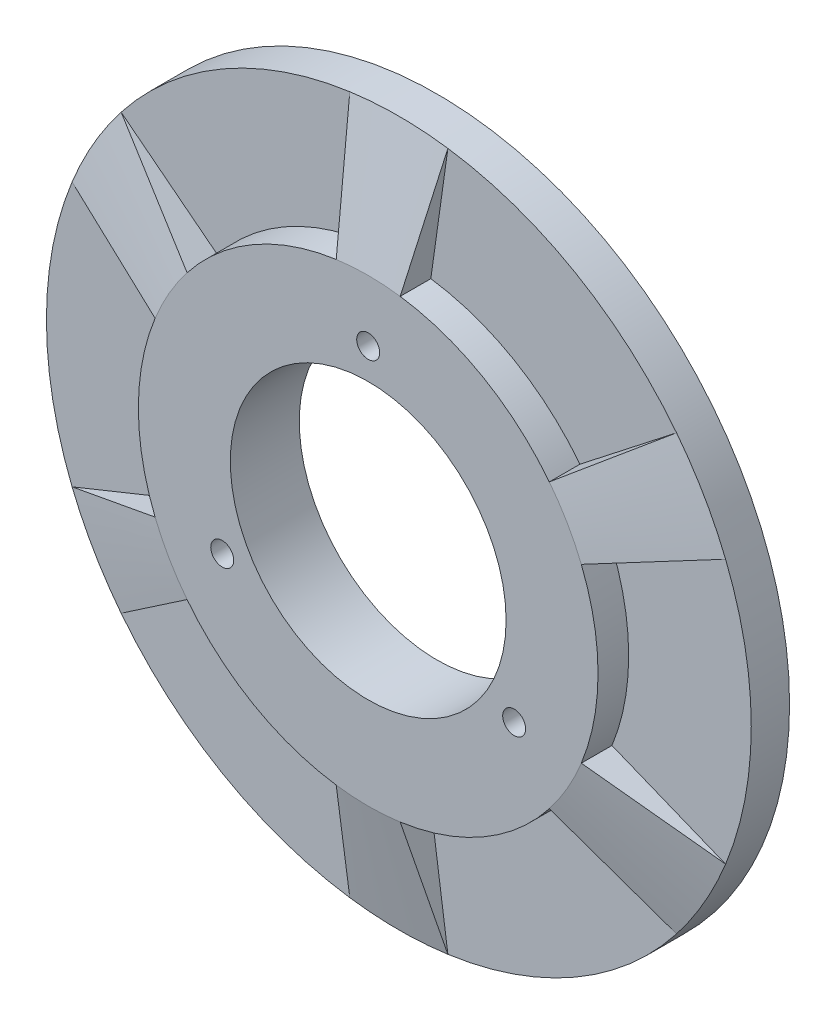
ISO-10303-21;
HEADER;
FILE_DESCRIPTION(('STEP AP214'),'2;1');
FILE_NAME('part.step','',(''),(''),'','','');
FILE_SCHEMA(('AUTOMOTIVE_DESIGN { 1 0 10303 214 1 1 1 1 }'));
ENDSEC;
DATA;
#1=APPLICATION_CONTEXT('core data for automotive mechanical design processes');
#2=APPLICATION_PROTOCOL_DEFINITION('international standard','automotive_design',2000,#1);
#3=PRODUCT_CONTEXT('',#1,'mechanical');
#4=PRODUCT('Part','Part','',(#3));
#5=PRODUCT_RELATED_PRODUCT_CATEGORY('part','',(#4));
#6=PRODUCT_DEFINITION_FORMATION('','',#4);
#7=PRODUCT_DEFINITION_CONTEXT('part definition',#1,'design');
#8=PRODUCT_DEFINITION('design','',#6,#7);
#9=PRODUCT_DEFINITION_SHAPE('','',#8);
#10=(LENGTH_UNIT() NAMED_UNIT(*) SI_UNIT(.MILLI.,.METRE.));
#11=(NAMED_UNIT(*) PLANE_ANGLE_UNIT() SI_UNIT($,.RADIAN.));
#12=(NAMED_UNIT(*) SI_UNIT($,.STERADIAN.) SOLID_ANGLE_UNIT());
#13=UNCERTAINTY_MEASURE_WITH_UNIT(LENGTH_MEASURE(1.E-05),#10,'distance_accuracy_value','');
#14=(GEOMETRIC_REPRESENTATION_CONTEXT(3) GLOBAL_UNCERTAINTY_ASSIGNED_CONTEXT((#13)) GLOBAL_UNIT_ASSIGNED_CONTEXT((#10,
#11,#12)) REPRESENTATION_CONTEXT('',''));
#15=CARTESIAN_POINT('',(0.,0.,0.));
#16=DIRECTION('',(0.,0.,1.));
#17=DIRECTION('',(1.,0.,0.));
#18=AXIS2_PLACEMENT_3D('',#15,#16,#17);
#19=CARTESIAN_POINT('',(0.,0.,5.));
#20=DIRECTION('',(0.,0.,1.));
#21=DIRECTION('',(1.,0.,0.));
#22=AXIS2_PLACEMENT_3D('',#19,#20,#21);
#23=PLANE('',#22);
#24=CARTESIAN_POINT('',(0.,0.,5.));
#25=DIRECTION('',(0.,0.,1.));
#26=DIRECTION('',(1.,0.,0.));
#27=AXIS2_PLACEMENT_3D('',#24,#25,#26);
#28=CIRCLE('',#27,46.);
#29=CARTESIAN_POINT('',(42.6504573100724,-17.2319032971315,5.));
#30=VERTEX_POINT('',#29);
#31=CARTESIAN_POINT('',(42.650457310072,17.2319032971324,5.));
#32=VERTEX_POINT('',#31);
#33=EDGE_CURVE('E241',#30,#32,#28,.T.);
#34=ORIENTED_EDGE('',*,*,#33,.T.);
#35=DIRECTION('',(0.927183854566783,0.374606593415923,0.));
#36=VECTOR('',#35,1.);
#37=CARTESIAN_POINT('',(42.650457310072,17.2319032971324,5.));
#38=LINE('',#37,#36);
#39=CARTESIAN_POINT('',(27.8155156370035,11.2381978024777,5.));
#40=VERTEX_POINT('',#39);
#41=EDGE_CURVE('E384',#40,#32,#38,.T.);
#42=ORIENTED_EDGE('',*,*,#41,.F.);
#43=CARTESIAN_POINT('',(0.,0.,5.));
#44=DIRECTION('',(0.,0.,1.));
#45=DIRECTION('',(1.,0.,0.));
#46=AXIS2_PLACEMENT_3D('',#43,#44,#45);
#47=CIRCLE('',#46,30.);
#48=CARTESIAN_POINT('',(27.8155156370037,-11.2381978024771,5.));
#49=VERTEX_POINT('',#48);
#50=EDGE_CURVE('E404',#49,#40,#47,.T.);
#51=ORIENTED_EDGE('',*,*,#50,.F.);
#52=DIRECTION('',(0.927183854566791,-0.374606593415903,0.));
#53=VECTOR('',#52,1.);
#54=CARTESIAN_POINT('',(42.6504573100724,-17.2319032971315,5.));
#55=LINE('',#54,#53);
#56=EDGE_CURVE('E377',#49,#30,#55,.T.);
#57=ORIENTED_EDGE('',*,*,#56,.T.);
#58=EDGE_LOOP('',(#34,#42,#51,#57));
#59=FACE_BOUND('',#58,.T.);
#60=ADVANCED_FACE('F86',(#59),#23,.T.);
#61=CARTESIAN_POINT('',(0.,0.,9.));
#62=DIRECTION('',(0.,0.,-1.));
#63=DIRECTION('',(-1.,0.,0.));
#64=AXIS2_PLACEMENT_3D('',#61,#62,#63);
#65=CYLINDRICAL_SURFACE('',#64,30.);
#66=DIRECTION('',(0.,0.,-1.));
#67=VECTOR('',#66,1.);
#68=CARTESIAN_POINT('',(27.8155156370035,11.2381978024777,5.));
#69=LINE('',#68,#67);
#70=CARTESIAN_POINT('',(27.8155156370035,11.2381978024777,9.));
#71=VERTEX_POINT('',#70);
#72=EDGE_CURVE('E225',#71,#40,#69,.T.);
#73=ORIENTED_EDGE('',*,*,#72,.F.);
#74=CARTESIAN_POINT('',(0.,0.,9.));
#75=DIRECTION('',(0.,0.,1.));
#76=DIRECTION('',(1.,0.,0.));
#77=AXIS2_PLACEMENT_3D('',#74,#75,#76);
#78=CIRCLE('',#77,30.);
#79=CARTESIAN_POINT('',(27.8155156370037,-11.2381978024771,9.));
#80=VERTEX_POINT('',#79);
#81=EDGE_CURVE('E391',#80,#71,#78,.T.);
#82=ORIENTED_EDGE('',*,*,#81,.F.);
#83=DIRECTION('',(0.,0.,-1.));
#84=VECTOR('',#83,1.);
#85=CARTESIAN_POINT('',(27.8155156370037,-11.2381978024771,5.));
#86=LINE('',#85,#84);
#87=EDGE_CURVE('E111',#80,#49,#86,.T.);
#88=ORIENTED_EDGE('',*,*,#87,.T.);
#89=ORIENTED_EDGE('',*,*,#50,.T.);
#90=EDGE_LOOP('',(#73,#82,#88,#89));
#91=FACE_BOUND('',#90,.T.);
#92=ADVANCED_FACE('F402',(#91),#65,.T.);
#93=CARTESIAN_POINT('',(6.40196264416302,-45.5523311621122,5.));
#94=VERTEX_POINT('',#93);
#95=CARTESIAN_POINT('',(36.2484946659095,-28.32042786498,5.));
#96=VERTEX_POINT('',#95);
#97=EDGE_CURVE('E242',#94,#96,#28,.T.);
#98=ORIENTED_EDGE('',*,*,#97,.T.);
#99=DIRECTION('',(0.788010753606727,-0.615661475325651,0.));
#100=VECTOR('',#99,1.);
#101=CARTESIAN_POINT('',(36.2484946659095,-28.32042786498,5.));
#102=LINE('',#101,#100);
#103=CARTESIAN_POINT('',(23.6403226082018,-18.4698442597695,5.));
#104=VERTEX_POINT('',#103);
#105=EDGE_CURVE('E371',#104,#96,#102,.T.);
#106=ORIENTED_EDGE('',*,*,#105,.F.);
#107=CARTESIAN_POINT('',(4.17519302880197,-29.7080420622471,5.));
#108=VERTEX_POINT('',#107);
#109=EDGE_CURVE('E406',#108,#104,#47,.T.);
#110=ORIENTED_EDGE('',*,*,#109,.F.);
#111=DIRECTION('',(0.139173100960066,-0.99026806874157,0.));
#112=VECTOR('',#111,1.);
#113=CARTESIAN_POINT('',(6.40196264416302,-45.5523311621122,5.));
#114=LINE('',#113,#112);
#115=EDGE_CURVE('E358',#108,#94,#114,.T.);
#116=ORIENTED_EDGE('',*,*,#115,.T.);
#117=EDGE_LOOP('',(#98,#106,#110,#116));
#118=FACE_BOUND('',#117,.T.);
#119=ADVANCED_FACE('F458',(#118),#23,.T.);
#120=DIRECTION('',(0.,0.,-1.));
#121=VECTOR('',#120,1.);
#122=CARTESIAN_POINT('',(23.6403226082018,-18.4698442597695,5.));
#123=LINE('',#122,#121);
#124=CARTESIAN_POINT('',(23.6403226082018,-18.4698442597695,9.));
#125=VERTEX_POINT('',#124);
#126=EDGE_CURVE('E366',#125,#104,#123,.T.);
#127=ORIENTED_EDGE('',*,*,#126,.F.);
#128=CARTESIAN_POINT('',(4.17519302880197,-29.7080420622471,9.));
#129=VERTEX_POINT('',#128);
#130=EDGE_CURVE('E806',#129,#125,#78,.T.);
#131=ORIENTED_EDGE('',*,*,#130,.F.);
#132=DIRECTION('',(0.,0.,-1.));
#133=VECTOR('',#132,1.);
#134=CARTESIAN_POINT('',(4.17519302880197,-29.7080420622471,5.));
#135=LINE('',#134,#133);
#136=EDGE_CURVE('E352',#129,#108,#135,.T.);
#137=ORIENTED_EDGE('',*,*,#136,.T.);
#138=ORIENTED_EDGE('',*,*,#109,.T.);
#139=EDGE_LOOP('',(#127,#131,#137,#138));
#140=FACE_BOUND('',#139,.T.);
#141=ADVANCED_FACE('F471',(#140),#65,.T.);
#142=CARTESIAN_POINT('',(-36.2484946659091,-28.3204278649805,5.));
#143=VERTEX_POINT('',#142);
#144=CARTESIAN_POINT('',(-6.40196264416302,-45.5523311621122,5.));
#145=VERTEX_POINT('',#144);
#146=EDGE_CURVE('E436',#143,#145,#28,.T.);
#147=ORIENTED_EDGE('',*,*,#146,.T.);
#148=DIRECTION('',(-0.139173100960066,-0.99026806874157,0.));
#149=VECTOR('',#148,1.);
#150=CARTESIAN_POINT('',(-6.40196264416302,-45.5523311621122,5.));
#151=LINE('',#150,#149);
#152=CARTESIAN_POINT('',(-4.17519302880197,-29.7080420622471,5.));
#153=VERTEX_POINT('',#152);
#154=EDGE_CURVE('E349',#153,#145,#151,.T.);
#155=ORIENTED_EDGE('',*,*,#154,.F.);
#156=CARTESIAN_POINT('',(-23.6403226082016,-18.4698442597699,5.));
#157=VERTEX_POINT('',#156);
#158=EDGE_CURVE('E408',#157,#153,#47,.T.);
#159=ORIENTED_EDGE('',*,*,#158,.F.);
#160=DIRECTION('',(-0.788010753606719,-0.615661475325662,0.));
#161=VECTOR('',#160,1.);
#162=CARTESIAN_POINT('',(-36.2484946659091,-28.3204278649805,5.));
#163=LINE('',#162,#161);
#164=EDGE_CURVE('E336',#157,#143,#163,.T.);
#165=ORIENTED_EDGE('',*,*,#164,.T.);
#166=EDGE_LOOP('',(#147,#155,#159,#165));
#167=FACE_BOUND('',#166,.T.);
#168=ADVANCED_FACE('F444',(#167),#23,.T.);
#169=DIRECTION('',(0.,0.,-1.));
#170=VECTOR('',#169,1.);
#171=CARTESIAN_POINT('',(-4.17519302880197,-29.7080420622471,5.));
#172=LINE('',#171,#170);
#173=CARTESIAN_POINT('',(-4.17519302880197,-29.7080420622471,9.));
#174=VERTEX_POINT('',#173);
#175=EDGE_CURVE('E344',#174,#153,#172,.T.);
#176=ORIENTED_EDGE('',*,*,#175,.F.);
#177=CARTESIAN_POINT('',(-23.6403226082016,-18.4698442597699,9.));
#178=VERTEX_POINT('',#177);
#179=EDGE_CURVE('E797',#178,#174,#78,.T.);
#180=ORIENTED_EDGE('',*,*,#179,.F.);
#181=DIRECTION('',(0.,0.,-1.));
#182=VECTOR('',#181,1.);
#183=CARTESIAN_POINT('',(-23.6403226082016,-18.4698442597699,5.));
#184=LINE('',#183,#182);
#185=EDGE_CURVE('E330',#178,#157,#184,.T.);
#186=ORIENTED_EDGE('',*,*,#185,.T.);
#187=ORIENTED_EDGE('',*,*,#158,.T.);
#188=EDGE_LOOP('',(#176,#180,#186,#187));
#189=FACE_BOUND('',#188,.T.);
#190=ADVANCED_FACE('F488',(#189),#65,.T.);
#191=CARTESIAN_POINT('',(-42.6504573100723,17.2319032971318,5.));
#192=VERTEX_POINT('',#191);
#193=CARTESIAN_POINT('',(-42.6504573100721,-17.2319032971321,5.));
#194=VERTEX_POINT('',#193);
#195=EDGE_CURVE('E428',#192,#194,#28,.T.);
#196=ORIENTED_EDGE('',*,*,#195,.T.);
#197=DIRECTION('',(-0.927183854566786,-0.374606593415916,0.));
#198=VECTOR('',#197,1.);
#199=CARTESIAN_POINT('',(-42.6504573100721,-17.2319032971321,5.));
#200=LINE('',#199,#198);
#201=CARTESIAN_POINT('',(-27.8155156370036,-11.2381978024775,5.));
#202=VERTEX_POINT('',#201);
#203=EDGE_CURVE('E327',#202,#194,#200,.T.);
#204=ORIENTED_EDGE('',*,*,#203,.F.);
#205=CARTESIAN_POINT('',(-27.8155156370036,11.2381978024773,5.));
#206=VERTEX_POINT('',#205);
#207=EDGE_CURVE('E253',#206,#202,#47,.T.);
#208=ORIENTED_EDGE('',*,*,#207,.F.);
#209=DIRECTION('',(-0.927183854566788,0.37460659341591,0.));
#210=VECTOR('',#209,1.);
#211=CARTESIAN_POINT('',(-42.6504573100723,17.2319032971318,5.));
#212=LINE('',#211,#210);
#213=EDGE_CURVE('E314',#206,#192,#212,.T.);
#214=ORIENTED_EDGE('',*,*,#213,.T.);
#215=EDGE_LOOP('',(#196,#204,#208,#214));
#216=FACE_BOUND('',#215,.T.);
#217=ADVANCED_FACE('F426',(#216),#23,.T.);
#218=DIRECTION('',(0.,0.,-1.));
#219=VECTOR('',#218,1.);
#220=CARTESIAN_POINT('',(-27.8155156370036,-11.2381978024775,5.));
#221=LINE('',#220,#219);
#222=CARTESIAN_POINT('',(-27.8155156370036,-11.2381978024775,9.));
#223=VERTEX_POINT('',#222);
#224=EDGE_CURVE('E322',#223,#202,#221,.T.);
#225=ORIENTED_EDGE('',*,*,#224,.F.);
#226=CARTESIAN_POINT('',(-27.8155156370036,11.2381978024773,9.));
#227=VERTEX_POINT('',#226);
#228=EDGE_CURVE('E796',#227,#223,#78,.T.);
#229=ORIENTED_EDGE('',*,*,#228,.F.);
#230=DIRECTION('',(0.,0.,-1.));
#231=VECTOR('',#230,1.);
#232=CARTESIAN_POINT('',(-27.8155156370036,11.2381978024773,5.));
#233=LINE('',#232,#231);
#234=EDGE_CURVE('E308',#227,#206,#233,.T.);
#235=ORIENTED_EDGE('',*,*,#234,.T.);
#236=ORIENTED_EDGE('',*,*,#207,.T.);
#237=EDGE_LOOP('',(#225,#229,#235,#236));
#238=FACE_BOUND('',#237,.T.);
#239=ADVANCED_FACE('F420',(#238),#65,.T.);
#240=CARTESIAN_POINT('',(-6.40196264416302,45.5523311621122,5.));
#241=VERTEX_POINT('',#240);
#242=CARTESIAN_POINT('',(-36.2484946659093,28.3204278649802,5.));
#243=VERTEX_POINT('',#242);
#244=EDGE_CURVE('E95',#241,#243,#28,.T.);
#245=ORIENTED_EDGE('',*,*,#244,.T.);
#246=DIRECTION('',(-0.788010753606723,0.615661475325657,0.));
#247=VECTOR('',#246,1.);
#248=CARTESIAN_POINT('',(-36.2484946659093,28.3204278649802,5.));
#249=LINE('',#248,#247);
#250=CARTESIAN_POINT('',(-23.6403226082017,18.4698442597697,5.));
#251=VERTEX_POINT('',#250);
#252=EDGE_CURVE('E305',#251,#243,#249,.T.);
#253=ORIENTED_EDGE('',*,*,#252,.F.);
#254=CARTESIAN_POINT('',(-4.17519302880197,29.7080420622471,5.));
#255=VERTEX_POINT('',#254);
#256=EDGE_CURVE('E249',#255,#251,#47,.T.);
#257=ORIENTED_EDGE('',*,*,#256,.F.);
#258=DIRECTION('',(-0.139173100960066,0.99026806874157,0.));
#259=VECTOR('',#258,1.);
#260=CARTESIAN_POINT('',(-6.40196264416302,45.5523311621122,5.));
#261=LINE('',#260,#259);
#262=EDGE_CURVE('E292',#255,#241,#261,.T.);
#263=ORIENTED_EDGE('',*,*,#262,.T.);
#264=EDGE_LOOP('',(#245,#253,#257,#263));
#265=FACE_BOUND('',#264,.T.);
#266=ADVANCED_FACE('F476',(#265),#23,.T.);
#267=DIRECTION('',(0.,0.,-1.));
#268=VECTOR('',#267,1.);
#269=CARTESIAN_POINT('',(-23.6403226082017,18.4698442597697,5.));
#270=LINE('',#269,#268);
#271=CARTESIAN_POINT('',(-23.6403226082017,18.4698442597697,9.));
#272=VERTEX_POINT('',#271);
#273=EDGE_CURVE('E300',#272,#251,#270,.T.);
#274=ORIENTED_EDGE('',*,*,#273,.F.);
#275=CARTESIAN_POINT('',(-4.17519302880197,29.7080420622471,9.));
#276=VERTEX_POINT('',#275);
#277=EDGE_CURVE('E256',#276,#272,#78,.T.);
#278=ORIENTED_EDGE('',*,*,#277,.F.);
#279=DIRECTION('',(0.,0.,-1.));
#280=VECTOR('',#279,1.);
#281=CARTESIAN_POINT('',(-4.17519302880197,29.7080420622471,5.));
#282=LINE('',#281,#280);
#283=EDGE_CURVE('E287',#276,#255,#282,.T.);
#284=ORIENTED_EDGE('',*,*,#283,.T.);
#285=ORIENTED_EDGE('',*,*,#256,.T.);
#286=EDGE_LOOP('',(#274,#278,#284,#285));
#287=FACE_BOUND('',#286,.T.);
#288=ADVANCED_FACE('F475',(#287),#65,.T.);
#289=DIRECTION('',(0.788010753606715,0.615661475325668,0.));
#290=VECTOR('',#289,1.);
#291=CARTESIAN_POINT('',(36.2484946659089,28.3204278649807,5.));
#292=LINE('',#291,#290);
#293=CARTESIAN_POINT('',(23.6403226082014,18.46984425977,5.));
#294=VERTEX_POINT('',#293);
#295=CARTESIAN_POINT('',(36.2484946659089,28.3204278649807,5.));
#296=VERTEX_POINT('',#295);
#297=EDGE_CURVE('E229',#294,#296,#292,.T.);
#298=ORIENTED_EDGE('',*,*,#297,.T.);
#299=CARTESIAN_POINT('',(6.40196264416302,45.5523311621122,5.));
#300=VERTEX_POINT('',#299);
#301=EDGE_CURVE('E96',#296,#300,#28,.T.);
#302=ORIENTED_EDGE('',*,*,#301,.T.);
#303=DIRECTION('',(0.139173100960066,0.99026806874157,0.));
#304=VECTOR('',#303,1.);
#305=CARTESIAN_POINT('',(6.40196264416302,45.5523311621122,5.));
#306=LINE('',#305,#304);
#307=CARTESIAN_POINT('',(4.17519302880197,29.7080420622471,5.));
#308=VERTEX_POINT('',#307);
#309=EDGE_CURVE('E284',#308,#300,#306,.T.);
#310=ORIENTED_EDGE('',*,*,#309,.F.);
#311=EDGE_CURVE('E236',#294,#308,#47,.T.);
#312=ORIENTED_EDGE('',*,*,#311,.F.);
#313=EDGE_LOOP('',(#298,#302,#310,#312));
#314=FACE_BOUND('',#313,.T.);
#315=ADVANCED_FACE('F233',(#314),#23,.T.);
#316=CARTESIAN_POINT('',(23.6403226082014,18.46984425977,9.));
#317=VERTEX_POINT('',#316);
#318=CARTESIAN_POINT('',(4.17519302880197,29.7080420622471,9.));
#319=VERTEX_POINT('',#318);
#320=EDGE_CURVE('E252',#317,#319,#78,.T.);
#321=ORIENTED_EDGE('',*,*,#320,.F.);
#322=DIRECTION('',(0.,0.,-1.));
#323=VECTOR('',#322,1.);
#324=CARTESIAN_POINT('',(23.6403226082014,18.46984425977,5.));
#325=LINE('',#324,#323);
#326=EDGE_CURVE('E103',#317,#294,#325,.T.);
#327=ORIENTED_EDGE('',*,*,#326,.T.);
#328=ORIENTED_EDGE('',*,*,#311,.T.);
#329=DIRECTION('',(0.,0.,-1.));
#330=VECTOR('',#329,1.);
#331=CARTESIAN_POINT('',(4.17519302880197,29.7080420622471,5.));
#332=LINE('',#331,#330);
#333=EDGE_CURVE('E274',#319,#308,#332,.T.);
#334=ORIENTED_EDGE('',*,*,#333,.F.);
#335=EDGE_LOOP('',(#321,#327,#328,#334));
#336=FACE_BOUND('',#335,.T.);
#337=ADVANCED_FACE('F387',(#336),#65,.T.);
#338=CARTESIAN_POINT('',(0.,0.,0.));
#339=DIRECTION('',(0.,0.,1.));
#340=DIRECTION('',(1.,0.,0.));
#341=AXIS2_PLACEMENT_3D('',#338,#339,#340);
#342=PLANE('',#341);
#343=CARTESIAN_POINT('',(0.,22.,0.));
#344=DIRECTION('',(0.,0.,1.));
#345=DIRECTION('',(1.,0.,0.));
#346=AXIS2_PLACEMENT_3D('',#343,#344,#345);
#347=CIRCLE('',#346,1.5);
#348=CARTESIAN_POINT('',(1.5,22.,0.));
#349=VERTEX_POINT('',#348);
#350=EDGE_CURVE('E260',#349,#349,#347,.T.);
#351=ORIENTED_EDGE('',*,*,#350,.T.);
#352=EDGE_LOOP('',(#351));
#353=FACE_BOUND('',#352,.T.);
#354=CARTESIAN_POINT('',(-19.0525588832577,-11.,0.));
#355=DIRECTION('',(0.,0.,1.));
#356=DIRECTION('',(1.,0.,0.));
#357=AXIS2_PLACEMENT_3D('',#354,#355,#356);
#358=CIRCLE('',#357,1.5);
#359=CARTESIAN_POINT('',(-17.5525588832577,-11.,0.));
#360=VERTEX_POINT('',#359);
#361=EDGE_CURVE('E263',#360,#360,#358,.T.);
#362=ORIENTED_EDGE('',*,*,#361,.T.);
#363=EDGE_LOOP('',(#362));
#364=FACE_BOUND('',#363,.T.);
#365=CARTESIAN_POINT('',(19.0525588832576,-11.,0.));
#366=DIRECTION('',(0.,0.,1.));
#367=DIRECTION('',(1.,0.,0.));
#368=AXIS2_PLACEMENT_3D('',#365,#366,#367);
#369=CIRCLE('',#368,1.5);
#370=CARTESIAN_POINT('',(20.5525588832576,-11.,0.));
#371=VERTEX_POINT('',#370);
#372=EDGE_CURVE('E266',#371,#371,#369,.T.);
#373=ORIENTED_EDGE('',*,*,#372,.T.);
#374=EDGE_LOOP('',(#373));
#375=FACE_BOUND('',#374,.T.);
#376=CARTESIAN_POINT('',(0.,0.,0.));
#377=DIRECTION('',(0.,0.,1.));
#378=DIRECTION('',(1.,0.,0.));
#379=AXIS2_PLACEMENT_3D('',#376,#377,#378);
#380=CIRCLE('',#379,46.);
#381=CARTESIAN_POINT('',(46.,0.,0.));
#382=VERTEX_POINT('',#381);
#383=EDGE_CURVE('E90',#382,#382,#380,.T.);
#384=ORIENTED_EDGE('',*,*,#383,.F.);
#385=EDGE_LOOP('',(#384));
#386=FACE_BOUND('',#385,.T.);
#387=CARTESIAN_POINT('',(0.,0.,0.));
#388=DIRECTION('',(0.,0.,1.));
#389=DIRECTION('',(1.,0.,0.));
#390=AXIS2_PLACEMENT_3D('',#387,#388,#389);
#391=CIRCLE('',#390,18.);
#392=CARTESIAN_POINT('',(18.,0.,0.));
#393=VERTEX_POINT('',#392);
#394=EDGE_CURVE('E244',#393,#393,#391,.T.);
#395=ORIENTED_EDGE('',*,*,#394,.T.);
#396=EDGE_LOOP('',(#395));
#397=FACE_BOUND('',#396,.T.);
#398=ADVANCED_FACE('F481',(#353,#364,#375,#386,#397),#342,.F.);
#399=CARTESIAN_POINT('',(0.,0.,5.));
#400=DIRECTION('',(0.,0.,-1.));
#401=DIRECTION('',(-1.,0.,0.));
#402=AXIS2_PLACEMENT_3D('',#399,#400,#401);
#403=CYLINDRICAL_SURFACE('',#402,46.);
#404=EDGE_CURVE('E12',#300,#241,#28,.T.);
#405=ORIENTED_EDGE('',*,*,#404,.F.);
#406=ORIENTED_EDGE('',*,*,#301,.F.);
#407=CARTESIAN_POINT('',(0.,0.,5.));
#408=DIRECTION('',(0.,0.,1.));
#409=DIRECTION('',(0.50000000000001,-0.866025403784433,0.));
#410=AXIS2_PLACEMENT_3D('',#407,#408,#409);
#411=CIRCLE('',#410,46.);
#412=EDGE_CURVE('E213',#32,#296,#411,.T.);
#413=ORIENTED_EDGE('',*,*,#412,.F.);
#414=ORIENTED_EDGE('',*,*,#33,.F.);
#415=CARTESIAN_POINT('',(0.,0.,5.));
#416=DIRECTION('',(0.,0.,1.));
#417=DIRECTION('',(-0.499999999999992,-0.866025403784443,0.));
#418=AXIS2_PLACEMENT_3D('',#415,#416,#417);
#419=CIRCLE('',#418,46.);
#420=EDGE_CURVE('E364',#96,#30,#419,.T.);
#421=ORIENTED_EDGE('',*,*,#420,.F.);
#422=ORIENTED_EDGE('',*,*,#97,.F.);
#423=CARTESIAN_POINT('',(0.,0.,5.));
#424=DIRECTION('',(0.,0.,1.));
#425=DIRECTION('',(-1.,0.,0.));
#426=AXIS2_PLACEMENT_3D('',#423,#424,#425);
#427=CIRCLE('',#426,46.);
#428=EDGE_CURVE('E342',#145,#94,#427,.T.);
#429=ORIENTED_EDGE('',*,*,#428,.F.);
#430=ORIENTED_EDGE('',*,*,#146,.F.);
#431=CARTESIAN_POINT('',(0.,0.,5.));
#432=DIRECTION('',(0.,0.,1.));
#433=DIRECTION('',(-0.500000000000004,0.866025403784436,0.));
#434=AXIS2_PLACEMENT_3D('',#431,#432,#433);
#435=CIRCLE('',#434,46.);
#436=EDGE_CURVE('E320',#194,#143,#435,.T.);
#437=ORIENTED_EDGE('',*,*,#436,.F.);
#438=ORIENTED_EDGE('',*,*,#195,.F.);
#439=CARTESIAN_POINT('',(0.,0.,5.));
#440=DIRECTION('',(0.,0.,1.));
#441=DIRECTION('',(0.499999999999998,0.86602540378444,0.));
#442=AXIS2_PLACEMENT_3D('',#439,#440,#441);
#443=CIRCLE('',#442,46.);
#444=EDGE_CURVE('E298',#243,#192,#443,.T.);
#445=ORIENTED_EDGE('',*,*,#444,.F.);
#446=ORIENTED_EDGE('',*,*,#244,.F.);
#447=EDGE_LOOP('',(#405,#406,#413,#414,#421,#422,#429,#430,#437,#438,#445,#446));
#448=FACE_BOUND('',#447,.T.);
#449=ORIENTED_EDGE('',*,*,#383,.T.);
#450=EDGE_LOOP('',(#449));
#451=FACE_BOUND('',#450,.T.);
#452=ADVANCED_FACE('F88',(#448,#451),#403,.T.);
#453=CARTESIAN_POINT('',(0.,0.,5.));
#454=DIRECTION('',(0.,0.,-1.));
#455=DIRECTION('',(-1.,0.,0.));
#456=AXIS2_PLACEMENT_3D('',#453,#454,#455);
#457=CYLINDRICAL_SURFACE('',#456,18.);
#458=ORIENTED_EDGE('',*,*,#394,.F.);
#459=EDGE_LOOP('',(#458));
#460=FACE_BOUND('',#459,.T.);
#461=CARTESIAN_POINT('',(0.,0.,9.));
#462=DIRECTION('',(0.,0.,1.));
#463=DIRECTION('',(1.,0.,0.));
#464=AXIS2_PLACEMENT_3D('',#461,#462,#463);
#465=CIRCLE('',#464,18.);
#466=CARTESIAN_POINT('',(18.,0.,9.));
#467=VERTEX_POINT('',#466);
#468=EDGE_CURVE('E257',#467,#467,#465,.T.);
#469=ORIENTED_EDGE('',*,*,#468,.T.);
#470=EDGE_LOOP('',(#469));
#471=FACE_BOUND('',#470,.T.);
#472=ADVANCED_FACE('F502',(#460,#471),#457,.F.);
#473=CARTESIAN_POINT('',(0.,0.,9.));
#474=DIRECTION('',(0.,0.,1.));
#475=DIRECTION('',(1.,0.,0.));
#476=AXIS2_PLACEMENT_3D('',#473,#474,#475);
#477=PLANE('',#476);
#478=CARTESIAN_POINT('',(0.,22.,9.));
#479=DIRECTION('',(0.,0.,-1.));
#480=DIRECTION('',(-1.,0.,0.));
#481=AXIS2_PLACEMENT_3D('',#478,#479,#480);
#482=CIRCLE('',#481,1.5);
#483=CARTESIAN_POINT('',(-1.5,22.,9.));
#484=VERTEX_POINT('',#483);
#485=EDGE_CURVE('E269',#484,#484,#482,.T.);
#486=ORIENTED_EDGE('',*,*,#485,.T.);
#487=EDGE_LOOP('',(#486));
#488=FACE_BOUND('',#487,.T.);
#489=CARTESIAN_POINT('',(-19.0525588832577,-11.,9.));
#490=DIRECTION('',(0.,0.,-1.));
#491=DIRECTION('',(-1.,0.,0.));
#492=AXIS2_PLACEMENT_3D('',#489,#490,#491);
#493=CIRCLE('',#492,1.5);
#494=CARTESIAN_POINT('',(-20.5525588832577,-11.,9.));
#495=VERTEX_POINT('',#494);
#496=EDGE_CURVE('E273',#495,#495,#493,.T.);
#497=ORIENTED_EDGE('',*,*,#496,.T.);
#498=EDGE_LOOP('',(#497));
#499=FACE_BOUND('',#498,.T.);
#500=CARTESIAN_POINT('',(19.0525588832576,-11.,9.));
#501=DIRECTION('',(0.,0.,-1.));
#502=DIRECTION('',(-1.,0.,0.));
#503=AXIS2_PLACEMENT_3D('',#500,#501,#502);
#504=CIRCLE('',#503,1.5);
#505=CARTESIAN_POINT('',(17.5525588832576,-11.,9.));
#506=VERTEX_POINT('',#505);
#507=EDGE_CURVE('E270',#506,#506,#504,.T.);
#508=ORIENTED_EDGE('',*,*,#507,.T.);
#509=EDGE_LOOP('',(#508));
#510=FACE_BOUND('',#509,.T.);
#511=EDGE_CURVE('E248',#319,#276,#78,.T.);
#512=ORIENTED_EDGE('',*,*,#511,.T.);
#513=ORIENTED_EDGE('',*,*,#277,.T.);
#514=CARTESIAN_POINT('',(0.,0.,9.));
#515=DIRECTION('',(0.,0.,1.));
#516=DIRECTION('',(0.499999999999998,0.86602540378444,0.));
#517=AXIS2_PLACEMENT_3D('',#514,#515,#516);
#518=CIRCLE('',#517,30.);
#519=EDGE_CURVE('E295',#272,#227,#518,.T.);
#520=ORIENTED_EDGE('',*,*,#519,.T.);
#521=ORIENTED_EDGE('',*,*,#228,.T.);
#522=CARTESIAN_POINT('',(0.,0.,9.));
#523=DIRECTION('',(0.,0.,1.));
#524=DIRECTION('',(-0.500000000000004,0.866025403784436,0.));
#525=AXIS2_PLACEMENT_3D('',#522,#523,#524);
#526=CIRCLE('',#525,30.);
#527=EDGE_CURVE('E317',#223,#178,#526,.T.);
#528=ORIENTED_EDGE('',*,*,#527,.T.);
#529=ORIENTED_EDGE('',*,*,#179,.T.);
#530=CARTESIAN_POINT('',(0.,0.,9.));
#531=DIRECTION('',(0.,0.,1.));
#532=DIRECTION('',(-1.,0.,0.));
#533=AXIS2_PLACEMENT_3D('',#530,#531,#532);
#534=CIRCLE('',#533,30.);
#535=EDGE_CURVE('E339',#174,#129,#534,.T.);
#536=ORIENTED_EDGE('',*,*,#535,.T.);
#537=ORIENTED_EDGE('',*,*,#130,.T.);
#538=CARTESIAN_POINT('',(0.,0.,9.));
#539=DIRECTION('',(0.,0.,1.));
#540=DIRECTION('',(-0.499999999999992,-0.866025403784443,0.));
#541=AXIS2_PLACEMENT_3D('',#538,#539,#540);
#542=CIRCLE('',#541,30.);
#543=EDGE_CURVE('E361',#125,#80,#542,.T.);
#544=ORIENTED_EDGE('',*,*,#543,.T.);
#545=ORIENTED_EDGE('',*,*,#81,.T.);
#546=CARTESIAN_POINT('',(0.,0.,9.));
#547=DIRECTION('',(0.,0.,1.));
#548=DIRECTION('',(0.50000000000001,-0.866025403784433,0.));
#549=AXIS2_PLACEMENT_3D('',#546,#547,#548);
#550=CIRCLE('',#549,30.);
#551=EDGE_CURVE('E224',#71,#317,#550,.T.);
#552=ORIENTED_EDGE('',*,*,#551,.T.);
#553=ORIENTED_EDGE('',*,*,#320,.T.);
#554=EDGE_LOOP('',(#512,#513,#520,#521,#528,#529,#536,#537,#544,#545,#552,#553));
#555=FACE_BOUND('',#554,.T.);
#556=ORIENTED_EDGE('',*,*,#468,.F.);
#557=EDGE_LOOP('',(#556));
#558=FACE_BOUND('',#557,.T.);
#559=ADVANCED_FACE('F393',(#488,#499,#510,#555,#558),#477,.T.);
#560=CARTESIAN_POINT('',(19.0525588832576,-11.,9.));
#561=DIRECTION('',(0.,0.,-1.));
#562=DIRECTION('',(-1.,0.,0.));
#563=AXIS2_PLACEMENT_3D('',#560,#561,#562);
#564=CYLINDRICAL_SURFACE('',#563,1.5);
#565=ORIENTED_EDGE('',*,*,#507,.F.);
#566=EDGE_LOOP('',(#565));
#567=FACE_BOUND('',#566,.T.);
#568=ORIENTED_EDGE('',*,*,#372,.F.);
#569=EDGE_LOOP('',(#568));
#570=FACE_BOUND('',#569,.T.);
#571=ADVANCED_FACE('F509',(#567,#570),#564,.F.);
#572=CARTESIAN_POINT('',(-19.0525588832577,-11.,9.));
#573=DIRECTION('',(0.,0.,-1.));
#574=DIRECTION('',(-1.,0.,0.));
#575=AXIS2_PLACEMENT_3D('',#572,#573,#574);
#576=CYLINDRICAL_SURFACE('',#575,1.5);
#577=ORIENTED_EDGE('',*,*,#496,.F.);
#578=EDGE_LOOP('',(#577));
#579=FACE_BOUND('',#578,.T.);
#580=ORIENTED_EDGE('',*,*,#361,.F.);
#581=EDGE_LOOP('',(#580));
#582=FACE_BOUND('',#581,.T.);
#583=ADVANCED_FACE('F528',(#579,#582),#576,.F.);
#584=CARTESIAN_POINT('',(0.,22.,9.));
#585=DIRECTION('',(0.,0.,-1.));
#586=DIRECTION('',(-1.,0.,0.));
#587=AXIS2_PLACEMENT_3D('',#584,#585,#586);
#588=CYLINDRICAL_SURFACE('',#587,1.5);
#589=ORIENTED_EDGE('',*,*,#485,.F.);
#590=EDGE_LOOP('',(#589));
#591=FACE_BOUND('',#590,.T.);
#592=ORIENTED_EDGE('',*,*,#350,.F.);
#593=EDGE_LOOP('',(#592));
#594=FACE_BOUND('',#593,.T.);
#595=ADVANCED_FACE('F533',(#591,#594),#588,.F.);
#596=CARTESIAN_POINT('',(0.,0.,5.));
#597=DIRECTION('',(0.,0.,-1.));
#598=DIRECTION('',(-1.,0.,0.));
#599=AXIS2_PLACEMENT_3D('',#596,#597,#598);
#600=CONICAL_SURFACE('',#599,46.,1.32581766366803);
#601=DIRECTION('',(-0.135017740118377,-0.960701140023036,0.242535625036333));
#602=VECTOR('',#601,1.);
#603=CARTESIAN_POINT('',(4.17519302880197,29.7080420622471,9.));
#604=LINE('',#603,#602);
#605=EDGE_CURVE('E281',#300,#319,#604,.T.);
#606=ORIENTED_EDGE('',*,*,#605,.F.);
#607=ORIENTED_EDGE('',*,*,#404,.T.);
#608=DIRECTION('',(0.135017740118377,-0.960701140023036,0.242535625036333));
#609=VECTOR('',#608,1.);
#610=CARTESIAN_POINT('',(-4.17519302880197,29.7080420622471,9.));
#611=LINE('',#610,#609);
#612=EDGE_CURVE('E290',#241,#276,#611,.T.);
#613=ORIENTED_EDGE('',*,*,#612,.T.);
#614=ORIENTED_EDGE('',*,*,#511,.F.);
#615=EDGE_LOOP('',(#606,#607,#613,#614));
#616=FACE_BOUND('',#615,.T.);
#617=ADVANCED_FACE('F540',(#616),#600,.T.);
#618=CARTESIAN_POINT('',(0.,0.,0.));
#619=DIRECTION('',(-0.99026806874157,0.139173100960066,0.));
#620=DIRECTION('',(0.,0.,1.));
#621=AXIS2_PLACEMENT_3D('',#618,#619,#620);
#622=PLANE('',#621);
#623=ORIENTED_EDGE('',*,*,#309,.T.);
#624=ORIENTED_EDGE('',*,*,#605,.T.);
#625=ORIENTED_EDGE('',*,*,#333,.T.);
#626=EDGE_LOOP('',(#623,#624,#625));
#627=FACE_BOUND('',#626,.T.);
#628=ADVANCED_FACE('F544',(#627),#622,.F.);
#629=CARTESIAN_POINT('',(0.,0.,0.));
#630=DIRECTION('',(-0.99026806874157,-0.139173100960066,0.));
#631=DIRECTION('',(0.,0.,1.));
#632=AXIS2_PLACEMENT_3D('',#629,#630,#631);
#633=PLANE('',#632);
#634=ORIENTED_EDGE('',*,*,#262,.F.);
#635=ORIENTED_EDGE('',*,*,#283,.F.);
#636=ORIENTED_EDGE('',*,*,#612,.F.);
#637=EDGE_LOOP('',(#634,#635,#636));
#638=FACE_BOUND('',#637,.T.);
#639=ADVANCED_FACE('F548',(#638),#633,.T.);
#640=CARTESIAN_POINT('',(0.,0.,5.));
#641=DIRECTION('',(0.,0.,-1.));
#642=DIRECTION('',(-0.499999999999998,-0.86602540378444,0.));
#643=AXIS2_PLACEMENT_3D('',#640,#641,#642);
#644=CONICAL_SURFACE('',#643,46.,1.32581766366803);
#645=DIRECTION('',(0.764482722645434,-0.597279362915596,0.242535625036333));
#646=VECTOR('',#645,1.);
#647=CARTESIAN_POINT('',(-23.6403226082017,18.4698442597697,9.));
#648=LINE('',#647,#646);
#649=EDGE_CURVE('E302',#243,#272,#648,.T.);
#650=ORIENTED_EDGE('',*,*,#649,.F.);
#651=ORIENTED_EDGE('',*,*,#444,.T.);
#652=DIRECTION('',(0.89950046276381,-0.363421777107436,0.242535625036333));
#653=VECTOR('',#652,1.);
#654=CARTESIAN_POINT('',(-27.8155156370036,11.2381978024773,9.));
#655=LINE('',#654,#653);
#656=EDGE_CURVE('E311',#192,#227,#655,.T.);
#657=ORIENTED_EDGE('',*,*,#656,.T.);
#658=ORIENTED_EDGE('',*,*,#519,.F.);
#659=EDGE_LOOP('',(#650,#651,#657,#658));
#660=FACE_BOUND('',#659,.T.);
#661=ADVANCED_FACE('F552',(#660),#644,.T.);
#662=CARTESIAN_POINT('',(0.,0.,0.));
#663=DIRECTION('',(-0.615661475325657,-0.788010753606723,0.));
#664=DIRECTION('',(0.,0.,1.));
#665=AXIS2_PLACEMENT_3D('',#662,#663,#664);
#666=PLANE('',#665);
#667=ORIENTED_EDGE('',*,*,#252,.T.);
#668=ORIENTED_EDGE('',*,*,#649,.T.);
#669=ORIENTED_EDGE('',*,*,#273,.T.);
#670=EDGE_LOOP('',(#667,#668,#669));
#671=FACE_BOUND('',#670,.T.);
#672=ADVANCED_FACE('F556',(#671),#666,.F.);
#673=CARTESIAN_POINT('',(0.,0.,0.));
#674=DIRECTION('',(-0.37460659341591,-0.927183854566788,0.));
#675=DIRECTION('',(0.,0.,1.));
#676=AXIS2_PLACEMENT_3D('',#673,#674,#675);
#677=PLANE('',#676);
#678=ORIENTED_EDGE('',*,*,#213,.F.);
#679=ORIENTED_EDGE('',*,*,#234,.F.);
#680=ORIENTED_EDGE('',*,*,#656,.F.);
#681=EDGE_LOOP('',(#678,#679,#680));
#682=FACE_BOUND('',#681,.T.);
#683=ADVANCED_FACE('F560',(#682),#677,.T.);
#684=CARTESIAN_POINT('',(0.,0.,5.));
#685=DIRECTION('',(0.,0.,-1.));
#686=DIRECTION('',(0.500000000000004,-0.866025403784436,0.));
#687=AXIS2_PLACEMENT_3D('',#684,#685,#686);
#688=CONICAL_SURFACE('',#687,46.,1.32581766366803);
#689=DIRECTION('',(0.899500462763807,0.363421777107443,0.242535625036333));
#690=VECTOR('',#689,1.);
#691=CARTESIAN_POINT('',(-27.8155156370036,-11.2381978024775,9.));
#692=LINE('',#691,#690);
#693=EDGE_CURVE('E324',#194,#223,#692,.T.);
#694=ORIENTED_EDGE('',*,*,#693,.F.);
#695=ORIENTED_EDGE('',*,*,#436,.T.);
#696=DIRECTION('',(0.764482722645429,0.597279362915602,0.242535625036333));
#697=VECTOR('',#696,1.);
#698=CARTESIAN_POINT('',(-23.6403226082016,-18.4698442597699,9.));
#699=LINE('',#698,#697);
#700=EDGE_CURVE('E333',#143,#178,#699,.T.);
#701=ORIENTED_EDGE('',*,*,#700,.T.);
#702=ORIENTED_EDGE('',*,*,#527,.F.);
#703=EDGE_LOOP('',(#694,#695,#701,#702));
#704=FACE_BOUND('',#703,.T.);
#705=ADVANCED_FACE('F439',(#704),#688,.T.);
#706=CARTESIAN_POINT('',(0.,0.,0.));
#707=DIRECTION('',(0.374606593415916,-0.927183854566786,0.));
#708=DIRECTION('',(0.,0.,1.));
#709=AXIS2_PLACEMENT_3D('',#706,#707,#708);
#710=PLANE('',#709);
#711=ORIENTED_EDGE('',*,*,#203,.T.);
#712=ORIENTED_EDGE('',*,*,#693,.T.);
#713=ORIENTED_EDGE('',*,*,#224,.T.);
#714=EDGE_LOOP('',(#711,#712,#713));
#715=FACE_BOUND('',#714,.T.);
#716=ADVANCED_FACE('F431',(#715),#710,.F.);
#717=CARTESIAN_POINT('',(0.,0.,0.));
#718=DIRECTION('',(0.615661475325662,-0.788010753606719,0.));
#719=DIRECTION('',(0.,0.,1.));
#720=AXIS2_PLACEMENT_3D('',#717,#718,#719);
#721=PLANE('',#720);
#722=ORIENTED_EDGE('',*,*,#164,.F.);
#723=ORIENTED_EDGE('',*,*,#185,.F.);
#724=ORIENTED_EDGE('',*,*,#700,.F.);
#725=EDGE_LOOP('',(#722,#723,#724));
#726=FACE_BOUND('',#725,.T.);
#727=ADVANCED_FACE('F442',(#726),#721,.T.);
#728=CARTESIAN_POINT('',(0.,0.,5.));
#729=DIRECTION('',(0.,0.,-1.));
#730=DIRECTION('',(1.,0.,0.));
#731=AXIS2_PLACEMENT_3D('',#728,#729,#730);
#732=CONICAL_SURFACE('',#731,46.,1.32581766366803);
#733=DIRECTION('',(0.135017740118377,0.960701140023036,0.242535625036333));
#734=VECTOR('',#733,1.);
#735=CARTESIAN_POINT('',(-4.17519302880197,-29.7080420622471,9.));
#736=LINE('',#735,#734);
#737=EDGE_CURVE('E346',#145,#174,#736,.T.);
#738=ORIENTED_EDGE('',*,*,#737,.F.);
#739=ORIENTED_EDGE('',*,*,#428,.T.);
#740=DIRECTION('',(-0.135017740118377,0.960701140023036,0.242535625036333));
#741=VECTOR('',#740,1.);
#742=CARTESIAN_POINT('',(4.17519302880197,-29.7080420622471,9.));
#743=LINE('',#742,#741);
#744=EDGE_CURVE('E355',#94,#129,#743,.T.);
#745=ORIENTED_EDGE('',*,*,#744,.T.);
#746=ORIENTED_EDGE('',*,*,#535,.F.);
#747=EDGE_LOOP('',(#738,#739,#745,#746));
#748=FACE_BOUND('',#747,.T.);
#749=ADVANCED_FACE('F453',(#748),#732,.T.);
#750=CARTESIAN_POINT('',(0.,0.,0.));
#751=DIRECTION('',(0.99026806874157,-0.139173100960066,0.));
#752=DIRECTION('',(0.,0.,1.));
#753=AXIS2_PLACEMENT_3D('',#750,#751,#752);
#754=PLANE('',#753);
#755=ORIENTED_EDGE('',*,*,#154,.T.);
#756=ORIENTED_EDGE('',*,*,#737,.T.);
#757=ORIENTED_EDGE('',*,*,#175,.T.);
#758=EDGE_LOOP('',(#755,#756,#757));
#759=FACE_BOUND('',#758,.T.);
#760=ADVANCED_FACE('F447',(#759),#754,.F.);
#761=CARTESIAN_POINT('',(0.,0.,0.));
#762=DIRECTION('',(0.99026806874157,0.139173100960066,0.));
#763=DIRECTION('',(0.,0.,1.));
#764=AXIS2_PLACEMENT_3D('',#761,#762,#763);
#765=PLANE('',#764);
#766=ORIENTED_EDGE('',*,*,#115,.F.);
#767=ORIENTED_EDGE('',*,*,#136,.F.);
#768=ORIENTED_EDGE('',*,*,#744,.F.);
#769=EDGE_LOOP('',(#766,#767,#768));
#770=FACE_BOUND('',#769,.T.);
#771=ADVANCED_FACE('F456',(#770),#765,.T.);
#772=CARTESIAN_POINT('',(0.,0.,5.));
#773=DIRECTION('',(0.,0.,-1.));
#774=DIRECTION('',(0.499999999999992,0.866025403784443,0.));
#775=AXIS2_PLACEMENT_3D('',#772,#773,#774);
#776=CONICAL_SURFACE('',#775,46.,1.32581766366803);
#777=DIRECTION('',(-0.764482722645438,0.597279362915591,0.242535625036333));
#778=VECTOR('',#777,1.);
#779=CARTESIAN_POINT('',(23.6403226082018,-18.4698442597695,9.));
#780=LINE('',#779,#778);
#781=EDGE_CURVE('E368',#96,#125,#780,.T.);
#782=ORIENTED_EDGE('',*,*,#781,.F.);
#783=ORIENTED_EDGE('',*,*,#420,.T.);
#784=DIRECTION('',(-0.899500462763812,0.36342177710743,0.242535625036333));
#785=VECTOR('',#784,1.);
#786=CARTESIAN_POINT('',(27.8155156370037,-11.2381978024771,9.));
#787=LINE('',#786,#785);
#788=EDGE_CURVE('E375',#30,#80,#787,.T.);
#789=ORIENTED_EDGE('',*,*,#788,.T.);
#790=ORIENTED_EDGE('',*,*,#543,.F.);
#791=EDGE_LOOP('',(#782,#783,#789,#790));
#792=FACE_BOUND('',#791,.T.);
#793=ADVANCED_FACE('F463',(#792),#776,.T.);
#794=CARTESIAN_POINT('',(0.,0.,0.));
#795=DIRECTION('',(0.615661475325651,0.788010753606727,0.));
#796=DIRECTION('',(0.,0.,1.));
#797=AXIS2_PLACEMENT_3D('',#794,#795,#796);
#798=PLANE('',#797);
#799=ORIENTED_EDGE('',*,*,#105,.T.);
#800=ORIENTED_EDGE('',*,*,#781,.T.);
#801=ORIENTED_EDGE('',*,*,#126,.T.);
#802=EDGE_LOOP('',(#799,#800,#801));
#803=FACE_BOUND('',#802,.T.);
#804=ADVANCED_FACE('F461',(#803),#798,.F.);
#805=CARTESIAN_POINT('',(0.,0.,0.));
#806=DIRECTION('',(0.374606593415903,0.927183854566791,0.));
#807=DIRECTION('',(0.,0.,1.));
#808=AXIS2_PLACEMENT_3D('',#805,#806,#807);
#809=PLANE('',#808);
#810=ORIENTED_EDGE('',*,*,#56,.F.);
#811=ORIENTED_EDGE('',*,*,#87,.F.);
#812=ORIENTED_EDGE('',*,*,#788,.F.);
#813=EDGE_LOOP('',(#810,#811,#812));
#814=FACE_BOUND('',#813,.T.);
#815=ADVANCED_FACE('F464',(#814),#809,.T.);
#816=CARTESIAN_POINT('',(0.,0.,5.));
#817=DIRECTION('',(0.,0.,-1.));
#818=DIRECTION('',(-0.50000000000001,0.866025403784433,0.));
#819=AXIS2_PLACEMENT_3D('',#816,#817,#818);
#820=CONICAL_SURFACE('',#819,46.,1.32581766366803);
#821=DIRECTION('',(-0.899500462763805,-0.363421777107449,0.242535625036333));
#822=VECTOR('',#821,1.);
#823=CARTESIAN_POINT('',(27.8155156370035,11.2381978024777,9.));
#824=LINE('',#823,#822);
#825=EDGE_CURVE('E218',#32,#71,#824,.T.);
#826=ORIENTED_EDGE('',*,*,#825,.F.);
#827=ORIENTED_EDGE('',*,*,#412,.T.);
#828=DIRECTION('',(-0.764482722645425,-0.597279362915607,0.242535625036333));
#829=VECTOR('',#828,1.);
#830=CARTESIAN_POINT('',(23.6403226082014,18.46984425977,9.));
#831=LINE('',#830,#829);
#832=EDGE_CURVE('E215',#296,#317,#831,.T.);
#833=ORIENTED_EDGE('',*,*,#832,.T.);
#834=ORIENTED_EDGE('',*,*,#551,.F.);
#835=EDGE_LOOP('',(#826,#827,#833,#834));
#836=FACE_BOUND('',#835,.T.);
#837=ADVANCED_FACE('F214',(#836),#820,.T.);
#838=CARTESIAN_POINT('',(0.,0.,0.));
#839=DIRECTION('',(-0.374606593415923,0.927183854566783,0.));
#840=DIRECTION('',(0.,0.,1.));
#841=AXIS2_PLACEMENT_3D('',#838,#839,#840);
#842=PLANE('',#841);
#843=ORIENTED_EDGE('',*,*,#41,.T.);
#844=ORIENTED_EDGE('',*,*,#825,.T.);
#845=ORIENTED_EDGE('',*,*,#72,.T.);
#846=EDGE_LOOP('',(#843,#844,#845));
#847=FACE_BOUND('',#846,.T.);
#848=ADVANCED_FACE('F398',(#847),#842,.F.);
#849=CARTESIAN_POINT('',(0.,0.,0.));
#850=DIRECTION('',(-0.615661475325668,0.788010753606715,0.));
#851=DIRECTION('',(0.,0.,1.));
#852=AXIS2_PLACEMENT_3D('',#849,#850,#851);
#853=PLANE('',#852);
#854=ORIENTED_EDGE('',*,*,#297,.F.);
#855=ORIENTED_EDGE('',*,*,#326,.F.);
#856=ORIENTED_EDGE('',*,*,#832,.F.);
#857=EDGE_LOOP('',(#854,#855,#856));
#858=FACE_BOUND('',#857,.T.);
#859=ADVANCED_FACE('F228',(#858),#853,.T.);
#860=CLOSED_SHELL('',(#60,#92,#119,#141,#168,#190,#217,#239,#266,#288,#315,#337,#398,#452,#472,
#559,#571,#583,#595,#617,#628,#639,#661,#672,#683,#705,#716,#727,#749,#760,#771,#793,#804,#815,
#837,#848,#859));
#861=MANIFOLD_SOLID_BREP('B2',#860);
#862=ADVANCED_BREP_SHAPE_REPRESENTATION('',(#18,#861),#14);
#863=SHAPE_DEFINITION_REPRESENTATION(#9,#862);
ENDSEC;
END-ISO-10303-21;
